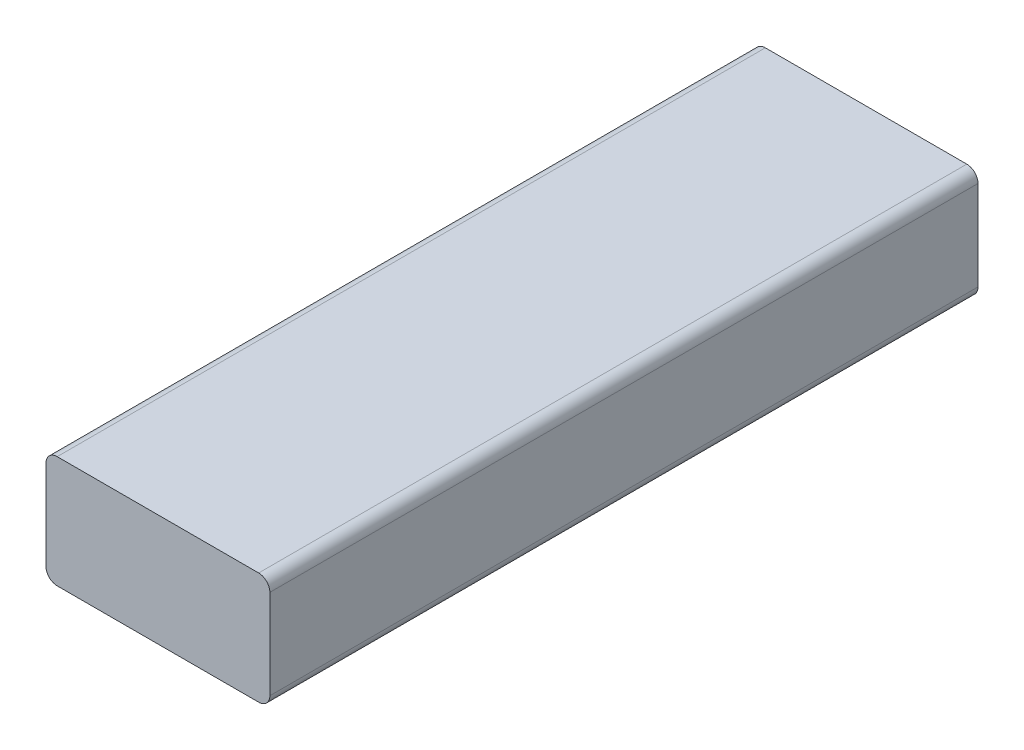
ISO-10303-21;
HEADER;
FILE_DESCRIPTION(('STEP AP214'),'2;1');
FILE_NAME('part.step','',(''),(''),'','','');
FILE_SCHEMA(('AUTOMOTIVE_DESIGN { 1 0 10303 214 1 1 1 1 }'));
ENDSEC;
DATA;
#1=APPLICATION_CONTEXT('core data for automotive mechanical design processes');
#2=APPLICATION_PROTOCOL_DEFINITION('international standard','automotive_design',2000,#1);
#3=PRODUCT_CONTEXT('',#1,'mechanical');
#4=PRODUCT('Part','Part','',(#3));
#5=PRODUCT_RELATED_PRODUCT_CATEGORY('part','',(#4));
#6=PRODUCT_DEFINITION_FORMATION('','',#4);
#7=PRODUCT_DEFINITION_CONTEXT('part definition',#1,'design');
#8=PRODUCT_DEFINITION('design','',#6,#7);
#9=PRODUCT_DEFINITION_SHAPE('','',#8);
#10=(LENGTH_UNIT() NAMED_UNIT(*) SI_UNIT(.MILLI.,.METRE.));
#11=(NAMED_UNIT(*) PLANE_ANGLE_UNIT() SI_UNIT($,.RADIAN.));
#12=(NAMED_UNIT(*) SI_UNIT($,.STERADIAN.) SOLID_ANGLE_UNIT());
#13=UNCERTAINTY_MEASURE_WITH_UNIT(LENGTH_MEASURE(1.E-05),#10,'distance_accuracy_value','');
#14=(GEOMETRIC_REPRESENTATION_CONTEXT(3) GLOBAL_UNCERTAINTY_ASSIGNED_CONTEXT((#13)) GLOBAL_UNIT_ASSIGNED_CONTEXT((#10,
#11,#12)) REPRESENTATION_CONTEXT('',''));
#15=CARTESIAN_POINT('',(0.,0.,0.));
#16=DIRECTION('',(0.,0.,1.));
#17=DIRECTION('',(1.,0.,0.));
#18=AXIS2_PLACEMENT_3D('',#15,#16,#17);
#19=CARTESIAN_POINT('',(1914.29999999996,38.0999999999985,-160.699999999997));
#20=DIRECTION('',(1.,0.,0.));
#21=DIRECTION('',(0.,1.,0.));
#22=AXIS2_PLACEMENT_3D('',#19,#20,#21);
#23=PLANE('',#22);
#24=DIRECTION('',(0.,-1.,0.));
#25=VECTOR('',#24,1.);
#26=CARTESIAN_POINT('',(1914.29999999996,38.1000000000043,160.700000000008));
#27=LINE('',#26,#25);
#28=CARTESIAN_POINT('',(1914.29999999996,33.0200000000043,160.700000000008));
#29=VERTEX_POINT('',#28);
#30=CARTESIAN_POINT('',(1914.29999999996,-7.61999999999568,160.700000000009));
#31=VERTEX_POINT('',#30);
#32=EDGE_CURVE('E155',#29,#31,#27,.T.);
#33=ORIENTED_EDGE('',*,*,#32,.T.);
#34=DIRECTION('',(0.,0.,1.));
#35=VECTOR('',#34,1.);
#36=CARTESIAN_POINT('',(1914.29999999996,-7.62000000000149,-160.699999999996));
#37=LINE('',#36,#35);
#38=CARTESIAN_POINT('',(1914.29999999996,-7.62000000000149,-160.699999999996));
#39=VERTEX_POINT('',#38);
#40=EDGE_CURVE('E113',#31,#39,#37,.F.);
#41=ORIENTED_EDGE('',*,*,#40,.T.);
#42=DIRECTION('',(0.,-1.,0.));
#43=VECTOR('',#42,1.);
#44=CARTESIAN_POINT('',(1914.29999999996,38.0999999999985,-160.699999999997));
#45=LINE('',#44,#43);
#46=CARTESIAN_POINT('',(1914.29999999996,33.0199999999985,-160.699999999996));
#47=VERTEX_POINT('',#46);
#48=EDGE_CURVE('E131',#47,#39,#45,.T.);
#49=ORIENTED_EDGE('',*,*,#48,.F.);
#50=DIRECTION('',(0.,0.,1.));
#51=VECTOR('',#50,1.);
#52=CARTESIAN_POINT('',(1914.29999999996,33.0200000000043,160.700000000008));
#53=LINE('',#52,#51);
#54=EDGE_CURVE('E185',#47,#29,#53,.T.);
#55=ORIENTED_EDGE('',*,*,#54,.T.);
#56=EDGE_LOOP('',(#33,#41,#49,#55));
#57=FACE_BOUND('',#56,.T.);
#58=ADVANCED_FACE('F43',(#57),#23,.T.);
#59=CARTESIAN_POINT('',(1914.29999999996,38.0999999999985,-160.699999999997));
#60=DIRECTION('',(0.,0.,-1.));
#61=DIRECTION('',(0.,1.,0.));
#62=AXIS2_PLACEMENT_3D('',#59,#60,#61);
#63=PLANE('',#62);
#64=DIRECTION('',(1.,0.,0.));
#65=VECTOR('',#64,1.);
#66=CARTESIAN_POINT('',(1914.29999999996,-12.7000000000015,-160.699999999996));
#67=LINE('',#66,#65);
#68=CARTESIAN_POINT('',(1817.77999999996,-12.700000000002,-160.699999999996));
#69=VERTEX_POINT('',#68);
#70=CARTESIAN_POINT('',(1909.21999999996,-12.7000000000015,-160.699999999996));
#71=VERTEX_POINT('',#70);
#72=EDGE_CURVE('E128',#69,#71,#67,.T.);
#73=ORIENTED_EDGE('',*,*,#72,.F.);
#74=CARTESIAN_POINT('',(1817.77999999996,-7.620000000002,-160.699999999996));
#75=DIRECTION('',(0.,0.,-1.));
#76=DIRECTION('',(0.,1.,0.));
#77=AXIS2_PLACEMENT_3D('',#74,#75,#76);
#78=CIRCLE('',#77,5.08);
#79=CARTESIAN_POINT('',(1812.69999999996,-7.62000000000202,-160.699999999996));
#80=VERTEX_POINT('',#79);
#81=EDGE_CURVE('E169',#69,#80,#78,.T.);
#82=ORIENTED_EDGE('',*,*,#81,.T.);
#83=DIRECTION('',(0.,-1.,0.));
#84=VECTOR('',#83,1.);
#85=CARTESIAN_POINT('',(1812.69999999996,38.099999999998,-160.699999999997));
#86=LINE('',#85,#84);
#87=CARTESIAN_POINT('',(1812.69999999996,33.019999999998,-160.699999999996));
#88=VERTEX_POINT('',#87);
#89=EDGE_CURVE('E148',#88,#80,#86,.T.);
#90=ORIENTED_EDGE('',*,*,#89,.F.);
#91=CARTESIAN_POINT('',(1817.77999999996,33.019999999998,-160.699999999996));
#92=DIRECTION('',(0.,0.,-1.));
#93=DIRECTION('',(0.,1.,0.));
#94=AXIS2_PLACEMENT_3D('',#91,#92,#93);
#95=CIRCLE('',#94,5.08);
#96=CARTESIAN_POINT('',(1817.77999999996,38.099999999998,-160.699999999997));
#97=VERTEX_POINT('',#96);
#98=EDGE_CURVE('E163',#88,#97,#95,.T.);
#99=ORIENTED_EDGE('',*,*,#98,.T.);
#100=DIRECTION('',(1.,0.,0.));
#101=VECTOR('',#100,1.);
#102=CARTESIAN_POINT('',(1914.29999999996,38.0999999999985,-160.699999999997));
#103=LINE('',#102,#101);
#104=CARTESIAN_POINT('',(1909.21999999996,38.0999999999985,-160.699999999997));
#105=VERTEX_POINT('',#104);
#106=EDGE_CURVE('E142',#97,#105,#103,.T.);
#107=ORIENTED_EDGE('',*,*,#106,.T.);
#108=CARTESIAN_POINT('',(1909.21999999996,33.0199999999985,-160.699999999996));
#109=DIRECTION('',(0.,0.,-1.));
#110=DIRECTION('',(0.,1.,0.));
#111=AXIS2_PLACEMENT_3D('',#108,#109,#110);
#112=CIRCLE('',#111,5.08);
#113=EDGE_CURVE('E160',#105,#47,#112,.T.);
#114=ORIENTED_EDGE('',*,*,#113,.T.);
#115=ORIENTED_EDGE('',*,*,#48,.T.);
#116=CARTESIAN_POINT('',(1909.21999999996,-7.62000000000152,-160.699999999996));
#117=DIRECTION('',(0.,0.,-1.));
#118=DIRECTION('',(0.,1.,0.));
#119=AXIS2_PLACEMENT_3D('',#116,#117,#118);
#120=CIRCLE('',#119,5.08);
#121=EDGE_CURVE('E166',#39,#71,#120,.T.);
#122=ORIENTED_EDGE('',*,*,#121,.T.);
#123=EDGE_LOOP('',(#73,#82,#90,#99,#107,#114,#115,#122));
#124=FACE_BOUND('',#123,.T.);
#125=ADVANCED_FACE('F197',(#124),#63,.T.);
#126=CARTESIAN_POINT('',(1812.69999999996,38.099999999998,-160.699999999997));
#127=DIRECTION('',(-1.,0.,0.));
#128=DIRECTION('',(0.,-1.,0.));
#129=AXIS2_PLACEMENT_3D('',#126,#127,#128);
#130=PLANE('',#129);
#131=ORIENTED_EDGE('',*,*,#89,.T.);
#132=DIRECTION('',(0.,0.,-1.));
#133=VECTOR('',#132,1.);
#134=CARTESIAN_POINT('',(1812.69999999996,-7.62000000000203,-160.699999999996));
#135=LINE('',#134,#133);
#136=CARTESIAN_POINT('',(1812.69999999996,-7.61999999999621,160.700000000009));
#137=VERTEX_POINT('',#136);
#138=EDGE_CURVE('E176',#80,#137,#135,.F.);
#139=ORIENTED_EDGE('',*,*,#138,.T.);
#140=DIRECTION('',(0.,-1.,0.));
#141=VECTOR('',#140,1.);
#142=CARTESIAN_POINT('',(1812.69999999996,38.1000000000038,160.700000000008));
#143=LINE('',#142,#141);
#144=CARTESIAN_POINT('',(1812.69999999996,33.0200000000038,160.700000000008));
#145=VERTEX_POINT('',#144);
#146=EDGE_CURVE('E152',#145,#137,#143,.T.);
#147=ORIENTED_EDGE('',*,*,#146,.F.);
#148=DIRECTION('',(0.,0.,-1.));
#149=VECTOR('',#148,1.);
#150=CARTESIAN_POINT('',(1812.69999999996,33.019999999998,-160.699999999996));
#151=LINE('',#150,#149);
#152=EDGE_CURVE('E172',#145,#88,#151,.T.);
#153=ORIENTED_EDGE('',*,*,#152,.T.);
#154=EDGE_LOOP('',(#131,#139,#147,#153));
#155=FACE_BOUND('',#154,.T.);
#156=ADVANCED_FACE('F206',(#155),#130,.T.);
#157=CARTESIAN_POINT('',(1914.29999999996,38.1000000000043,160.700000000008));
#158=DIRECTION('',(0.,0.,1.));
#159=DIRECTION('',(0.,-1.,0.));
#160=AXIS2_PLACEMENT_3D('',#157,#158,#159);
#161=PLANE('',#160);
#162=ORIENTED_EDGE('',*,*,#146,.T.);
#163=CARTESIAN_POINT('',(1817.77999999996,-7.61999999999618,160.700000000009));
#164=DIRECTION('',(0.,0.,1.));
#165=DIRECTION('',(0.,-1.,0.));
#166=AXIS2_PLACEMENT_3D('',#163,#164,#165);
#167=CIRCLE('',#166,5.08);
#168=CARTESIAN_POINT('',(1817.77999999996,-12.6999999999962,160.700000000009));
#169=VERTEX_POINT('',#168);
#170=EDGE_CURVE('E117',#137,#169,#167,.T.);
#171=ORIENTED_EDGE('',*,*,#170,.T.);
#172=DIRECTION('',(-1.,0.,0.));
#173=VECTOR('',#172,1.);
#174=CARTESIAN_POINT('',(1914.29999999996,-12.6999999999957,160.700000000009));
#175=LINE('',#174,#173);
#176=CARTESIAN_POINT('',(1909.21999999996,-12.6999999999957,160.700000000009));
#177=VERTEX_POINT('',#176);
#178=EDGE_CURVE('E125',#177,#169,#175,.T.);
#179=ORIENTED_EDGE('',*,*,#178,.F.);
#180=CARTESIAN_POINT('',(1909.21999999996,-7.61999999999571,160.700000000009));
#181=DIRECTION('',(0.,0.,1.));
#182=DIRECTION('',(0.,-1.,0.));
#183=AXIS2_PLACEMENT_3D('',#180,#181,#182);
#184=CIRCLE('',#183,5.08);
#185=EDGE_CURVE('E108',#177,#31,#184,.T.);
#186=ORIENTED_EDGE('',*,*,#185,.T.);
#187=ORIENTED_EDGE('',*,*,#32,.F.);
#188=CARTESIAN_POINT('',(1909.21999999996,33.0200000000043,160.700000000008));
#189=DIRECTION('',(0.,0.,1.));
#190=DIRECTION('',(0.,-1.,0.));
#191=AXIS2_PLACEMENT_3D('',#188,#189,#190);
#192=CIRCLE('',#191,5.08);
#193=CARTESIAN_POINT('',(1909.21999999996,38.1000000000043,160.700000000008));
#194=VERTEX_POINT('',#193);
#195=EDGE_CURVE('E64',#29,#194,#192,.T.);
#196=ORIENTED_EDGE('',*,*,#195,.T.);
#197=DIRECTION('',(-1.,0.,0.));
#198=VECTOR('',#197,1.);
#199=CARTESIAN_POINT('',(1914.29999999996,38.1000000000043,160.700000000008));
#200=LINE('',#199,#198);
#201=CARTESIAN_POINT('',(1817.77999999996,38.1000000000038,160.700000000008));
#202=VERTEX_POINT('',#201);
#203=EDGE_CURVE('E139',#194,#202,#200,.T.);
#204=ORIENTED_EDGE('',*,*,#203,.T.);
#205=CARTESIAN_POINT('',(1817.77999999996,33.0200000000038,160.700000000008));
#206=DIRECTION('',(0.,0.,1.));
#207=DIRECTION('',(0.,-1.,0.));
#208=AXIS2_PLACEMENT_3D('',#205,#206,#207);
#209=CIRCLE('',#208,5.08);
#210=EDGE_CURVE('E118',#202,#145,#209,.T.);
#211=ORIENTED_EDGE('',*,*,#210,.T.);
#212=EDGE_LOOP('',(#162,#171,#179,#186,#187,#196,#204,#211));
#213=FACE_BOUND('',#212,.T.);
#214=ADVANCED_FACE('F134',(#213),#161,.T.);
#215=CARTESIAN_POINT('',(-1.99258099982953E-13,38.0999999999914,-6.88849415960972E-13));
#216=DIRECTION('',(0.,-1.,0.));
#217=DIRECTION('',(0.,0.,-1.));
#218=AXIS2_PLACEMENT_3D('',#215,#216,#217);
#219=PLANE('',#218);
#220=ORIENTED_EDGE('',*,*,#106,.F.);
#221=DIRECTION('',(0.,0.,-1.));
#222=VECTOR('',#221,1.);
#223=CARTESIAN_POINT('',(1817.77999999996,38.1000000000038,160.700000000008));
#224=LINE('',#223,#222);
#225=EDGE_CURVE('E11',#97,#202,#224,.F.);
#226=ORIENTED_EDGE('',*,*,#225,.T.);
#227=ORIENTED_EDGE('',*,*,#203,.F.);
#228=DIRECTION('',(0.,0.,1.));
#229=VECTOR('',#228,1.);
#230=CARTESIAN_POINT('',(1909.21999999996,38.0999999999985,-160.699999999997));
#231=LINE('',#230,#229);
#232=EDGE_CURVE('E52',#194,#105,#231,.F.);
#233=ORIENTED_EDGE('',*,*,#232,.T.);
#234=EDGE_LOOP('',(#220,#226,#227,#233));
#235=FACE_BOUND('',#234,.T.);
#236=ADVANCED_FACE('F193',(#235),#219,.F.);
#237=CARTESIAN_POINT('',(0.,-12.7000000000086,2.29632265978476E-13));
#238=DIRECTION('',(0.,-1.,0.));
#239=DIRECTION('',(0.,0.,-1.));
#240=AXIS2_PLACEMENT_3D('',#237,#238,#239);
#241=PLANE('',#240);
#242=ORIENTED_EDGE('',*,*,#178,.T.);
#243=DIRECTION('',(0.,0.,-1.));
#244=VECTOR('',#243,1.);
#245=CARTESIAN_POINT('',(1817.77999999996,-12.6999999999991,2.29632265978304E-13));
#246=LINE('',#245,#244);
#247=EDGE_CURVE('E130',#169,#69,#246,.T.);
#248=ORIENTED_EDGE('',*,*,#247,.T.);
#249=ORIENTED_EDGE('',*,*,#72,.T.);
#250=DIRECTION('',(0.,0.,1.));
#251=VECTOR('',#250,1.);
#252=CARTESIAN_POINT('',(1909.21999999996,-12.6999999999986,2.29632265978296E-13));
#253=LINE('',#252,#251);
#254=EDGE_CURVE('E112',#71,#177,#253,.T.);
#255=ORIENTED_EDGE('',*,*,#254,.T.);
#256=EDGE_LOOP('',(#242,#248,#249,#255));
#257=FACE_BOUND('',#256,.T.);
#258=ADVANCED_FACE('F123',(#257),#241,.T.);
#259=CARTESIAN_POINT('',(1817.77999999996,-7.61999999999909,1.37779359586976E-13));
#260=DIRECTION('',(0.,0.,-1.));
#261=DIRECTION('',(0.,1.,0.));
#262=AXIS2_PLACEMENT_3D('',#259,#260,#261);
#263=CYLINDRICAL_SURFACE('',#262,5.08);
#264=ORIENTED_EDGE('',*,*,#170,.F.);
#265=ORIENTED_EDGE('',*,*,#138,.F.);
#266=ORIENTED_EDGE('',*,*,#81,.F.);
#267=ORIENTED_EDGE('',*,*,#247,.F.);
#268=EDGE_LOOP('',(#264,#265,#266,#267));
#269=FACE_BOUND('',#268,.T.);
#270=ADVANCED_FACE('F209',(#269),#263,.T.);
#271=CARTESIAN_POINT('',(1909.21999999996,-7.61999999999861,1.37779359586967E-13));
#272=DIRECTION('',(0.,0.,1.));
#273=DIRECTION('',(0.,-1.,0.));
#274=AXIS2_PLACEMENT_3D('',#271,#272,#273);
#275=CYLINDRICAL_SURFACE('',#274,5.08);
#276=ORIENTED_EDGE('',*,*,#121,.F.);
#277=ORIENTED_EDGE('',*,*,#40,.F.);
#278=ORIENTED_EDGE('',*,*,#185,.F.);
#279=ORIENTED_EDGE('',*,*,#254,.F.);
#280=EDGE_LOOP('',(#276,#277,#278,#279));
#281=FACE_BOUND('',#280,.T.);
#282=ADVANCED_FACE('F111',(#281),#275,.T.);
#283=CARTESIAN_POINT('',(1817.77999999996,33.019999999998,-160.699999999996));
#284=DIRECTION('',(0.,0.,1.));
#285=DIRECTION('',(0.,-1.,0.));
#286=AXIS2_PLACEMENT_3D('',#283,#284,#285);
#287=CYLINDRICAL_SURFACE('',#286,5.08);
#288=ORIENTED_EDGE('',*,*,#210,.F.);
#289=ORIENTED_EDGE('',*,*,#225,.F.);
#290=ORIENTED_EDGE('',*,*,#98,.F.);
#291=ORIENTED_EDGE('',*,*,#152,.F.);
#292=EDGE_LOOP('',(#288,#289,#290,#291));
#293=FACE_BOUND('',#292,.T.);
#294=ADVANCED_FACE('F216',(#293),#287,.T.);
#295=CARTESIAN_POINT('',(1909.21999999996,33.0199999999985,-160.699999999996));
#296=DIRECTION('',(0.,0.,-1.));
#297=DIRECTION('',(0.,1.,0.));
#298=AXIS2_PLACEMENT_3D('',#295,#296,#297);
#299=CYLINDRICAL_SURFACE('',#298,5.08);
#300=ORIENTED_EDGE('',*,*,#113,.F.);
#301=ORIENTED_EDGE('',*,*,#232,.F.);
#302=ORIENTED_EDGE('',*,*,#195,.F.);
#303=ORIENTED_EDGE('',*,*,#54,.F.);
#304=EDGE_LOOP('',(#300,#301,#302,#303));
#305=FACE_BOUND('',#304,.T.);
#306=ADVANCED_FACE('F45',(#305),#299,.T.);
#307=CLOSED_SHELL('',(#58,#125,#156,#214,#236,#258,#270,#282,#294,#306));
#308=MANIFOLD_SOLID_BREP('B2',#307);
#309=ADVANCED_BREP_SHAPE_REPRESENTATION('',(#18,#308),#14);
#310=SHAPE_DEFINITION_REPRESENTATION(#9,#309);
ENDSEC;
END-ISO-10303-21;
